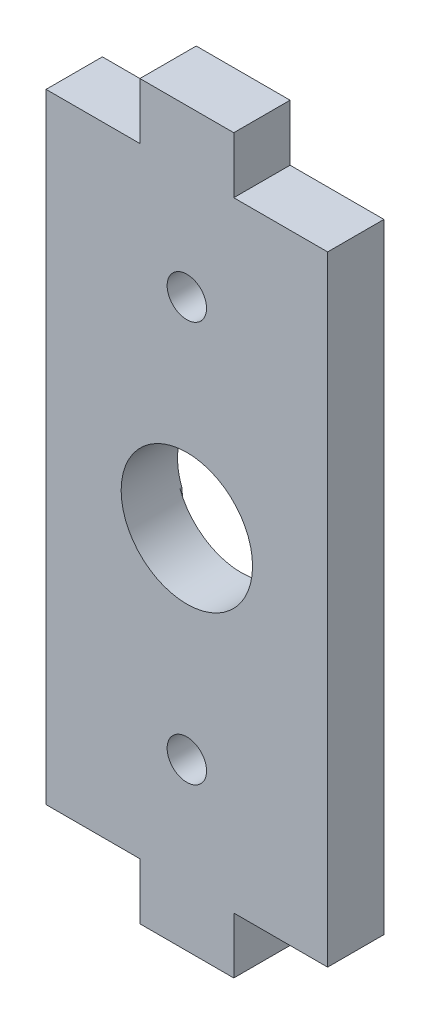
ISO-10303-21;
HEADER;
FILE_DESCRIPTION(('STEP AP214'),'2;1');
FILE_NAME('part.step','',(''),(''),'','','');
FILE_SCHEMA(('AUTOMOTIVE_DESIGN { 1 0 10303 214 1 1 1 1 }'));
ENDSEC;
DATA;
#1=APPLICATION_CONTEXT('core data for automotive mechanical design processes');
#2=APPLICATION_PROTOCOL_DEFINITION('international standard','automotive_design',2000,#1);
#3=PRODUCT_CONTEXT('',#1,'mechanical');
#4=PRODUCT('Part','Part','',(#3));
#5=PRODUCT_RELATED_PRODUCT_CATEGORY('part','',(#4));
#6=PRODUCT_DEFINITION_FORMATION('','',#4);
#7=PRODUCT_DEFINITION_CONTEXT('part definition',#1,'design');
#8=PRODUCT_DEFINITION('design','',#6,#7);
#9=PRODUCT_DEFINITION_SHAPE('','',#8);
#10=(LENGTH_UNIT() NAMED_UNIT(*) SI_UNIT(.MILLI.,.METRE.));
#11=(NAMED_UNIT(*) PLANE_ANGLE_UNIT() SI_UNIT($,.RADIAN.));
#12=(NAMED_UNIT(*) SI_UNIT($,.STERADIAN.) SOLID_ANGLE_UNIT());
#13=UNCERTAINTY_MEASURE_WITH_UNIT(LENGTH_MEASURE(1.E-05),#10,'distance_accuracy_value','');
#14=(GEOMETRIC_REPRESENTATION_CONTEXT(3) GLOBAL_UNCERTAINTY_ASSIGNED_CONTEXT((#13)) GLOBAL_UNIT_ASSIGNED_CONTEXT((#10,
#11,#12)) REPRESENTATION_CONTEXT('',''));
#15=CARTESIAN_POINT('',(0.,0.,0.));
#16=DIRECTION('',(0.,0.,1.));
#17=DIRECTION('',(1.,0.,0.));
#18=AXIS2_PLACEMENT_3D('',#15,#16,#17);
#19=CARTESIAN_POINT('',(0.,0.,0.));
#20=DIRECTION('',(0.,0.,-1.));
#21=DIRECTION('',(-1.,0.,0.));
#22=AXIS2_PLACEMENT_3D('',#19,#20,#21);
#23=PLANE('',#22);
#24=DIRECTION('',(0.,1.,0.));
#25=VECTOR('',#24,1.);
#26=CARTESIAN_POINT('',(28.7000000000005,-4.20000000000046,0.));
#27=LINE('',#26,#25);
#28=CARTESIAN_POINT('',(28.7000000000005,-4.20000000000046,0.));
#29=VERTEX_POINT('',#28);
#30=CARTESIAN_POINT('',(28.7000000000005,-1.20000000000046,0.));
#31=VERTEX_POINT('',#30);
#32=EDGE_CURVE('E247',#29,#31,#27,.T.);
#33=ORIENTED_EDGE('',*,*,#32,.F.);
#34=DIRECTION('',(1.,0.,0.));
#35=VECTOR('',#34,1.);
#36=CARTESIAN_POINT('',(28.7000000000005,-4.20000000000046,0.));
#37=LINE('',#36,#35);
#38=CARTESIAN_POINT('',(23.7000000000005,-4.20000000000046,0.));
#39=VERTEX_POINT('',#38);
#40=EDGE_CURVE('E252',#39,#29,#37,.T.);
#41=ORIENTED_EDGE('',*,*,#40,.F.);
#42=DIRECTION('',(0.,-1.,0.));
#43=VECTOR('',#42,1.);
#44=CARTESIAN_POINT('',(23.7000000000005,-1.20000000000046,0.));
#45=LINE('',#44,#43);
#46=CARTESIAN_POINT('',(23.7000000000005,-1.20000000000046,0.));
#47=VERTEX_POINT('',#46);
#48=EDGE_CURVE('E297',#47,#39,#45,.T.);
#49=ORIENTED_EDGE('',*,*,#48,.F.);
#50=DIRECTION('',(1.,0.,0.));
#51=VECTOR('',#50,1.);
#52=CARTESIAN_POINT('',(18.6999999999996,-1.20000000000046,0.));
#53=LINE('',#52,#51);
#54=CARTESIAN_POINT('',(18.6999999999996,-1.20000000000046,0.));
#55=VERTEX_POINT('',#54);
#56=EDGE_CURVE('E295',#55,#47,#53,.T.);
#57=ORIENTED_EDGE('',*,*,#56,.F.);
#58=DIRECTION('',(0.,-1.,0.));
#59=VECTOR('',#58,1.);
#60=CARTESIAN_POINT('',(18.6999999999996,9.79999999999946,0.));
#61=LINE('',#60,#59);
#62=CARTESIAN_POINT('',(18.6999999999996,31.8000000000005,0.));
#63=VERTEX_POINT('',#62);
#64=EDGE_CURVE('E293',#63,#55,#61,.T.);
#65=ORIENTED_EDGE('',*,*,#64,.F.);
#66=DIRECTION('',(-1.,0.,0.));
#67=VECTOR('',#66,1.);
#68=CARTESIAN_POINT('',(23.7000000000005,31.8000000000005,0.));
#69=LINE('',#68,#67);
#70=CARTESIAN_POINT('',(23.7000000000005,31.8000000000005,0.));
#71=VERTEX_POINT('',#70);
#72=EDGE_CURVE('E290',#71,#63,#69,.T.);
#73=ORIENTED_EDGE('',*,*,#72,.F.);
#74=DIRECTION('',(0.,-1.,0.));
#75=VECTOR('',#74,1.);
#76=CARTESIAN_POINT('',(23.7000000000005,34.8000000000005,0.));
#77=LINE('',#76,#75);
#78=CARTESIAN_POINT('',(23.7000000000005,34.8000000000005,0.));
#79=VERTEX_POINT('',#78);
#80=EDGE_CURVE('E288',#79,#71,#77,.T.);
#81=ORIENTED_EDGE('',*,*,#80,.F.);
#82=DIRECTION('',(-1.,0.,0.));
#83=VECTOR('',#82,1.);
#84=CARTESIAN_POINT('',(28.7000000000005,34.8000000000005,0.));
#85=LINE('',#84,#83);
#86=CARTESIAN_POINT('',(28.7000000000005,34.8000000000005,0.));
#87=VERTEX_POINT('',#86);
#88=EDGE_CURVE('E286',#87,#79,#85,.T.);
#89=ORIENTED_EDGE('',*,*,#88,.F.);
#90=DIRECTION('',(0.,1.,0.));
#91=VECTOR('',#90,1.);
#92=CARTESIAN_POINT('',(28.7000000000005,31.8000000000005,0.));
#93=LINE('',#92,#91);
#94=CARTESIAN_POINT('',(28.7000000000005,31.8000000000005,0.));
#95=VERTEX_POINT('',#94);
#96=EDGE_CURVE('E284',#95,#87,#93,.T.);
#97=ORIENTED_EDGE('',*,*,#96,.F.);
#98=DIRECTION('',(-1.,0.,0.));
#99=VECTOR('',#98,1.);
#100=CARTESIAN_POINT('',(33.7000000000005,31.8000000000005,0.));
#101=LINE('',#100,#99);
#102=CARTESIAN_POINT('',(33.7000000000005,31.8000000000005,0.));
#103=VERTEX_POINT('',#102);
#104=EDGE_CURVE('E282',#103,#95,#101,.T.);
#105=ORIENTED_EDGE('',*,*,#104,.F.);
#106=DIRECTION('',(0.,1.,0.));
#107=VECTOR('',#106,1.);
#108=CARTESIAN_POINT('',(33.7000000000005,15.8000000000001,0.));
#109=LINE('',#108,#107);
#110=CARTESIAN_POINT('',(33.7000000000005,-1.20000000000046,0.));
#111=VERTEX_POINT('',#110);
#112=EDGE_CURVE('E280',#111,#103,#109,.T.);
#113=ORIENTED_EDGE('',*,*,#112,.F.);
#114=DIRECTION('',(1.,0.,0.));
#115=VECTOR('',#114,1.);
#116=CARTESIAN_POINT('',(28.7000000000005,-1.20000000000046,0.));
#117=LINE('',#116,#115);
#118=EDGE_CURVE('E277',#31,#111,#117,.T.);
#119=ORIENTED_EDGE('',*,*,#118,.F.);
#120=EDGE_LOOP('',(#33,#41,#49,#57,#65,#73,#81,#89,#97,#105,#113,#119));
#121=FACE_BOUND('',#120,.T.);
#122=CARTESIAN_POINT('',(26.2000000000005,15.2999999999997,0.));
#123=DIRECTION('',(0.,0.,1.));
#124=DIRECTION('',(1.,0.,0.));
#125=AXIS2_PLACEMENT_3D('',#122,#123,#124);
#126=CIRCLE('',#125,3.5);
#127=CARTESIAN_POINT('',(22.9308257923256,16.5499999999897,0.));
#128=VERTEX_POINT('',#127);
#129=CARTESIAN_POINT('',(22.9308257922595,14.0500000001457,0.));
#130=VERTEX_POINT('',#129);
#131=EDGE_CURVE('E239',#128,#130,#126,.T.);
#132=ORIENTED_EDGE('',*,*,#131,.T.);
#133=DIRECTION('',(0.0967980247525778,-0.995304045206287,0.));
#134=VECTOR('',#133,1.);
#135=CARTESIAN_POINT('',(24.1999999999996,1.00000000000055,0.));
#136=LINE('',#135,#134);
#137=CARTESIAN_POINT('',(24.1999999999996,1.00000000000055,0.));
#138=VERTEX_POINT('',#137);
#139=EDGE_CURVE('E197',#130,#138,#136,.T.);
#140=ORIENTED_EDGE('',*,*,#139,.T.);
#141=CARTESIAN_POINT('',(26.2,1.00000000000055,0.));
#142=DIRECTION('',(0.,0.,1.));
#143=DIRECTION('',(1.,0.,0.));
#144=AXIS2_PLACEMENT_3D('',#141,#142,#143);
#145=CIRCLE('',#144,2.00000000000045);
#146=CARTESIAN_POINT('',(28.2000000000005,1.00000000000055,0.));
#147=VERTEX_POINT('',#146);
#148=EDGE_CURVE('E185',#138,#147,#145,.T.);
#149=ORIENTED_EDGE('',*,*,#148,.T.);
#150=DIRECTION('',(0.0967980247485113,0.995304045206683,0.));
#151=VECTOR('',#150,1.);
#152=CARTESIAN_POINT('',(29.4691742076735,14.0500000000095,0.));
#153=LINE('',#152,#151);
#154=CARTESIAN_POINT('',(29.4691742076735,14.0500000000095,0.));
#155=VERTEX_POINT('',#154);
#156=EDGE_CURVE('E200',#147,#155,#153,.T.);
#157=ORIENTED_EDGE('',*,*,#156,.T.);
#158=CARTESIAN_POINT('',(29.4691742077414,16.5499999998535,0.));
#159=VERTEX_POINT('',#158);
#160=EDGE_CURVE('E234',#155,#159,#126,.T.);
#161=ORIENTED_EDGE('',*,*,#160,.T.);
#162=DIRECTION('',(-0.0983012262714601,0.995156705706959,0.));
#163=VECTOR('',#162,1.);
#164=CARTESIAN_POINT('',(28.1903134114006,29.4966024525005,0.));
#165=LINE('',#164,#163);
#166=CARTESIAN_POINT('',(28.1903134114006,29.4966024525005,0.));
#167=VERTEX_POINT('',#166);
#168=EDGE_CURVE('E217',#159,#167,#165,.T.);
#169=ORIENTED_EDGE('',*,*,#168,.T.);
#170=CARTESIAN_POINT('',(26.1999999999917,29.2999999999868,0.));
#171=DIRECTION('',(0.,0.,1.));
#172=DIRECTION('',(1.,0.,0.));
#173=AXIS2_PLACEMENT_3D('',#170,#171,#172);
#174=CIRCLE('',#173,1.99999999999215);
#175=CARTESIAN_POINT('',(24.1999999999996,29.2999999999868,0.));
#176=VERTEX_POINT('',#175);
#177=EDGE_CURVE('E220',#167,#176,#174,.T.);
#178=ORIENTED_EDGE('',*,*,#177,.T.);
#179=DIRECTION('',(-0.0990535328176179,-0.995082105977366,0.));
#180=VECTOR('',#179,1.);
#181=CARTESIAN_POINT('',(22.9308257923256,16.5499999999897,0.));
#182=LINE('',#181,#180);
#183=EDGE_CURVE('E210',#176,#128,#182,.T.);
#184=ORIENTED_EDGE('',*,*,#183,.T.);
#185=EDGE_LOOP('',(#132,#140,#149,#157,#161,#169,#178,#184));
#186=FACE_BOUND('',#185,.T.);
#187=ADVANCED_FACE('F33',(#121,#186),#23,.T.);
#188=CARTESIAN_POINT('',(26.2000000000005,15.2999999999997,3.));
#189=DIRECTION('',(0.,0.,-1.));
#190=DIRECTION('',(-1.,0.,0.));
#191=AXIS2_PLACEMENT_3D('',#188,#189,#190);
#192=CYLINDRICAL_SURFACE('',#191,3.5);
#193=CARTESIAN_POINT('',(26.2000000000005,15.2999999999997,3.));
#194=DIRECTION('',(0.,0.,1.));
#195=DIRECTION('',(1.,0.,0.));
#196=AXIS2_PLACEMENT_3D('',#193,#194,#195);
#197=CIRCLE('',#196,3.5);
#198=CARTESIAN_POINT('',(29.7000000000005,15.2999999999997,3.));
#199=VERTEX_POINT('',#198);
#200=EDGE_CURVE('E235',#199,#199,#197,.T.);
#201=ORIENTED_EDGE('',*,*,#200,.T.);
#202=EDGE_LOOP('',(#201));
#203=FACE_BOUND('',#202,.T.);
#204=CARTESIAN_POINT('',(26.2000000000075,15.3000000000575,0.1));
#205=DIRECTION('',(0.,0.,-1.));
#206=DIRECTION('',(1.,0.,0.));
#207=AXIS2_PLACEMENT_3D('',#204,#205,#206);
#208=CIRCLE('',#207,3.50000000004092);
#209=CARTESIAN_POINT('',(29.4691742076735,14.0500000000095,0.1));
#210=VERTEX_POINT('',#209);
#211=CARTESIAN_POINT('',(22.9308257922853,14.0500000001555,0.0999999999999998));
#212=VERTEX_POINT('',#211);
#213=EDGE_CURVE('E179',#210,#212,#208,.T.);
#214=ORIENTED_EDGE('',*,*,#213,.T.);
#215=DIRECTION('',(0.,0.,-1.));
#216=VECTOR('',#215,1.);
#217=CARTESIAN_POINT('',(22.9308257922595,14.0500000001457,0.1));
#218=LINE('',#217,#216);
#219=EDGE_CURVE('E49',#212,#130,#218,.T.);
#220=ORIENTED_EDGE('',*,*,#219,.T.);
#221=ORIENTED_EDGE('',*,*,#131,.F.);
#222=DIRECTION('',(0.,0.,-1.));
#223=VECTOR('',#222,1.);
#224=CARTESIAN_POINT('',(22.9308257923256,16.5499999999897,0.1));
#225=LINE('',#224,#223);
#226=CARTESIAN_POINT('',(22.9308257923256,16.5499999999897,0.1));
#227=VERTEX_POINT('',#226);
#228=EDGE_CURVE('E216',#227,#128,#225,.T.);
#229=ORIENTED_EDGE('',*,*,#228,.F.);
#230=CARTESIAN_POINT('',(26.2000000000075,15.3000000000575,0.1));
#231=DIRECTION('',(0.,0.,-1.));
#232=DIRECTION('',(1.,0.,0.));
#233=AXIS2_PLACEMENT_3D('',#230,#231,#232);
#234=CIRCLE('',#233,3.5000000000004);
#235=CARTESIAN_POINT('',(29.4691742077156,16.5499999998437,0.0999999999999998));
#236=VERTEX_POINT('',#235);
#237=EDGE_CURVE('E206',#227,#236,#234,.T.);
#238=ORIENTED_EDGE('',*,*,#237,.T.);
#239=DIRECTION('',(0.,0.,-1.));
#240=VECTOR('',#239,1.);
#241=CARTESIAN_POINT('',(29.4691742077414,16.5499999998535,0.1));
#242=LINE('',#241,#240);
#243=EDGE_CURVE('E57',#236,#159,#242,.T.);
#244=ORIENTED_EDGE('',*,*,#243,.T.);
#245=ORIENTED_EDGE('',*,*,#160,.F.);
#246=DIRECTION('',(0.,0.,-1.));
#247=VECTOR('',#246,1.);
#248=CARTESIAN_POINT('',(29.4691742076735,14.0500000000095,0.1));
#249=LINE('',#248,#247);
#250=EDGE_CURVE('E193',#210,#155,#249,.T.);
#251=ORIENTED_EDGE('',*,*,#250,.F.);
#252=EDGE_LOOP('',(#214,#220,#221,#229,#238,#244,#245,#251));
#253=FACE_BOUND('',#252,.T.);
#254=ADVANCED_FACE('F399',(#203,#253),#192,.F.);
#255=CARTESIAN_POINT('',(0.,0.,3.));
#256=DIRECTION('',(0.,0.,-1.));
#257=DIRECTION('',(-1.,0.,0.));
#258=AXIS2_PLACEMENT_3D('',#255,#256,#257);
#259=PLANE('',#258);
#260=DIRECTION('',(0.,1.,0.));
#261=VECTOR('',#260,1.);
#262=CARTESIAN_POINT('',(28.7000000000005,-4.20000000000046,3.));
#263=LINE('',#262,#261);
#264=CARTESIAN_POINT('',(28.7000000000005,-4.20000000000046,3.));
#265=VERTEX_POINT('',#264);
#266=CARTESIAN_POINT('',(28.7000000000005,-1.20000000000046,3.));
#267=VERTEX_POINT('',#266);
#268=EDGE_CURVE('E248',#265,#267,#263,.T.);
#269=ORIENTED_EDGE('',*,*,#268,.T.);
#270=DIRECTION('',(1.,0.,0.));
#271=VECTOR('',#270,1.);
#272=CARTESIAN_POINT('',(28.7000000000005,-1.20000000000046,3.));
#273=LINE('',#272,#271);
#274=CARTESIAN_POINT('',(33.7000000000005,-1.20000000000046,3.));
#275=VERTEX_POINT('',#274);
#276=EDGE_CURVE('E251',#267,#275,#273,.T.);
#277=ORIENTED_EDGE('',*,*,#276,.T.);
#278=DIRECTION('',(0.,1.,0.));
#279=VECTOR('',#278,1.);
#280=CARTESIAN_POINT('',(33.7000000000005,-1.20000000000046,3.));
#281=LINE('',#280,#279);
#282=CARTESIAN_POINT('',(33.7000000000005,31.8000000000005,3.));
#283=VERTEX_POINT('',#282);
#284=EDGE_CURVE('E254',#275,#283,#281,.T.);
#285=ORIENTED_EDGE('',*,*,#284,.T.);
#286=DIRECTION('',(-1.,0.,0.));
#287=VECTOR('',#286,1.);
#288=CARTESIAN_POINT('',(33.7000000000005,31.8000000000005,3.));
#289=LINE('',#288,#287);
#290=CARTESIAN_POINT('',(28.7000000000005,31.8000000000005,3.));
#291=VERTEX_POINT('',#290);
#292=EDGE_CURVE('E256',#283,#291,#289,.T.);
#293=ORIENTED_EDGE('',*,*,#292,.T.);
#294=DIRECTION('',(0.,1.,0.));
#295=VECTOR('',#294,1.);
#296=CARTESIAN_POINT('',(28.7000000000005,31.8000000000005,3.));
#297=LINE('',#296,#295);
#298=CARTESIAN_POINT('',(28.7000000000005,34.8000000000005,3.));
#299=VERTEX_POINT('',#298);
#300=EDGE_CURVE('E258',#291,#299,#297,.T.);
#301=ORIENTED_EDGE('',*,*,#300,.T.);
#302=DIRECTION('',(-1.,0.,0.));
#303=VECTOR('',#302,1.);
#304=CARTESIAN_POINT('',(28.7000000000005,34.8000000000005,3.));
#305=LINE('',#304,#303);
#306=CARTESIAN_POINT('',(23.7000000000005,34.8000000000005,3.));
#307=VERTEX_POINT('',#306);
#308=EDGE_CURVE('E260',#299,#307,#305,.T.);
#309=ORIENTED_EDGE('',*,*,#308,.T.);
#310=DIRECTION('',(0.,-1.,0.));
#311=VECTOR('',#310,1.);
#312=CARTESIAN_POINT('',(23.7000000000005,34.8000000000005,3.));
#313=LINE('',#312,#311);
#314=CARTESIAN_POINT('',(23.7000000000005,31.8000000000005,3.));
#315=VERTEX_POINT('',#314);
#316=EDGE_CURVE('E262',#307,#315,#313,.T.);
#317=ORIENTED_EDGE('',*,*,#316,.T.);
#318=DIRECTION('',(-1.,0.,0.));
#319=VECTOR('',#318,1.);
#320=CARTESIAN_POINT('',(23.7000000000005,31.8000000000005,3.));
#321=LINE('',#320,#319);
#322=CARTESIAN_POINT('',(18.6999999999996,31.8000000000005,3.));
#323=VERTEX_POINT('',#322);
#324=EDGE_CURVE('E264',#315,#323,#321,.T.);
#325=ORIENTED_EDGE('',*,*,#324,.T.);
#326=DIRECTION('',(0.,-1.,0.));
#327=VECTOR('',#326,1.);
#328=CARTESIAN_POINT('',(18.6999999999996,31.8000000000005,3.));
#329=LINE('',#328,#327);
#330=CARTESIAN_POINT('',(18.6999999999996,-1.20000000000046,3.));
#331=VERTEX_POINT('',#330);
#332=EDGE_CURVE('E266',#323,#331,#329,.T.);
#333=ORIENTED_EDGE('',*,*,#332,.T.);
#334=DIRECTION('',(1.,0.,0.));
#335=VECTOR('',#334,1.);
#336=CARTESIAN_POINT('',(18.6999999999996,-1.20000000000046,3.));
#337=LINE('',#336,#335);
#338=CARTESIAN_POINT('',(23.7000000000005,-1.20000000000046,3.));
#339=VERTEX_POINT('',#338);
#340=EDGE_CURVE('E268',#331,#339,#337,.T.);
#341=ORIENTED_EDGE('',*,*,#340,.T.);
#342=DIRECTION('',(0.,-1.,0.));
#343=VECTOR('',#342,1.);
#344=CARTESIAN_POINT('',(23.7000000000005,-1.20000000000046,3.));
#345=LINE('',#344,#343);
#346=CARTESIAN_POINT('',(23.7000000000005,-4.20000000000046,3.));
#347=VERTEX_POINT('',#346);
#348=EDGE_CURVE('E270',#339,#347,#345,.T.);
#349=ORIENTED_EDGE('',*,*,#348,.T.);
#350=DIRECTION('',(1.,0.,0.));
#351=VECTOR('',#350,1.);
#352=CARTESIAN_POINT('',(28.7000000000005,-4.20000000000046,3.));
#353=LINE('',#352,#351);
#354=EDGE_CURVE('E272',#347,#265,#353,.T.);
#355=ORIENTED_EDGE('',*,*,#354,.T.);
#356=EDGE_LOOP('',(#269,#277,#285,#293,#301,#309,#317,#325,#333,#341,#349,#355));
#357=FACE_BOUND('',#356,.T.);
#358=CARTESIAN_POINT('',(26.2000000000005,25.9722294535005,3.));
#359=DIRECTION('',(0.,0.,1.));
#360=DIRECTION('',(1.,0.,0.));
#361=AXIS2_PLACEMENT_3D('',#358,#359,#360);
#362=CIRCLE('',#361,1.05);
#363=CARTESIAN_POINT('',(27.2500000000005,25.9722294535005,3.));
#364=VERTEX_POINT('',#363);
#365=EDGE_CURVE('E244',#364,#364,#362,.T.);
#366=ORIENTED_EDGE('',*,*,#365,.F.);
#367=EDGE_LOOP('',(#366));
#368=FACE_BOUND('',#367,.T.);
#369=CARTESIAN_POINT('',(26.2000000000005,4.62777054650046,3.));
#370=DIRECTION('',(0.,0.,1.));
#371=DIRECTION('',(1.,0.,0.));
#372=AXIS2_PLACEMENT_3D('',#369,#370,#371);
#373=CIRCLE('',#372,1.05);
#374=CARTESIAN_POINT('',(27.2500000000005,4.62777054650046,3.));
#375=VERTEX_POINT('',#374);
#376=EDGE_CURVE('E238',#375,#375,#373,.T.);
#377=ORIENTED_EDGE('',*,*,#376,.F.);
#378=EDGE_LOOP('',(#377));
#379=FACE_BOUND('',#378,.T.);
#380=ORIENTED_EDGE('',*,*,#200,.F.);
#381=EDGE_LOOP('',(#380));
#382=FACE_BOUND('',#381,.T.);
#383=ADVANCED_FACE('F355',(#357,#368,#379,#382),#259,.F.);
#384=CARTESIAN_POINT('',(28.7000000000005,-4.20000000000046,3.));
#385=DIRECTION('',(-1.,0.,0.));
#386=DIRECTION('',(0.,0.,1.));
#387=AXIS2_PLACEMENT_3D('',#384,#385,#386);
#388=PLANE('',#387);
#389=ORIENTED_EDGE('',*,*,#32,.T.);
#390=DIRECTION('',(0.,0.,-1.));
#391=VECTOR('',#390,1.);
#392=CARTESIAN_POINT('',(28.7000000000005,-1.20000000000046,3.));
#393=LINE('',#392,#391);
#394=EDGE_CURVE('E11',#267,#31,#393,.T.);
#395=ORIENTED_EDGE('',*,*,#394,.F.);
#396=ORIENTED_EDGE('',*,*,#268,.F.);
#397=DIRECTION('',(0.,0.,-1.));
#398=VECTOR('',#397,1.);
#399=CARTESIAN_POINT('',(28.7000000000005,-4.20000000000046,3.));
#400=LINE('',#399,#398);
#401=EDGE_CURVE('E274',#265,#29,#400,.T.);
#402=ORIENTED_EDGE('',*,*,#401,.T.);
#403=EDGE_LOOP('',(#389,#395,#396,#402));
#404=FACE_BOUND('',#403,.T.);
#405=ADVANCED_FACE('F35',(#404),#388,.F.);
#406=CARTESIAN_POINT('',(28.7000000000005,-1.20000000000046,3.));
#407=DIRECTION('',(0.,1.,0.));
#408=DIRECTION('',(0.,0.,1.));
#409=AXIS2_PLACEMENT_3D('',#406,#407,#408);
#410=PLANE('',#409);
#411=ORIENTED_EDGE('',*,*,#118,.T.);
#412=DIRECTION('',(0.,0.,-1.));
#413=VECTOR('',#412,1.);
#414=CARTESIAN_POINT('',(33.7000000000005,-1.20000000000046,3.));
#415=LINE('',#414,#413);
#416=EDGE_CURVE('E42',#275,#111,#415,.T.);
#417=ORIENTED_EDGE('',*,*,#416,.F.);
#418=ORIENTED_EDGE('',*,*,#276,.F.);
#419=ORIENTED_EDGE('',*,*,#394,.T.);
#420=EDGE_LOOP('',(#411,#417,#418,#419));
#421=FACE_BOUND('',#420,.T.);
#422=ADVANCED_FACE('F336',(#421),#410,.F.);
#423=CARTESIAN_POINT('',(33.7000000000005,15.8000000000001,3.));
#424=DIRECTION('',(-1.,0.,0.));
#425=DIRECTION('',(0.,0.,1.));
#426=AXIS2_PLACEMENT_3D('',#423,#424,#425);
#427=PLANE('',#426);
#428=ORIENTED_EDGE('',*,*,#112,.T.);
#429=DIRECTION('',(0.,0.,-1.));
#430=VECTOR('',#429,1.);
#431=CARTESIAN_POINT('',(33.7000000000005,31.8000000000005,3.));
#432=LINE('',#431,#430);
#433=EDGE_CURVE('E326',#283,#103,#432,.T.);
#434=ORIENTED_EDGE('',*,*,#433,.F.);
#435=ORIENTED_EDGE('',*,*,#284,.F.);
#436=ORIENTED_EDGE('',*,*,#416,.T.);
#437=EDGE_LOOP('',(#428,#434,#435,#436));
#438=FACE_BOUND('',#437,.T.);
#439=ADVANCED_FACE('F333',(#438),#427,.F.);
#440=CARTESIAN_POINT('',(33.7000000000005,31.8000000000005,3.));
#441=DIRECTION('',(0.,-1.,0.));
#442=DIRECTION('',(0.,0.,-1.));
#443=AXIS2_PLACEMENT_3D('',#440,#441,#442);
#444=PLANE('',#443);
#445=ORIENTED_EDGE('',*,*,#104,.T.);
#446=DIRECTION('',(0.,0.,-1.));
#447=VECTOR('',#446,1.);
#448=CARTESIAN_POINT('',(28.7000000000005,31.8000000000005,3.));
#449=LINE('',#448,#447);
#450=EDGE_CURVE('E323',#291,#95,#449,.T.);
#451=ORIENTED_EDGE('',*,*,#450,.F.);
#452=ORIENTED_EDGE('',*,*,#292,.F.);
#453=ORIENTED_EDGE('',*,*,#433,.T.);
#454=EDGE_LOOP('',(#445,#451,#452,#453));
#455=FACE_BOUND('',#454,.T.);
#456=ADVANCED_FACE('F347',(#455),#444,.F.);
#457=CARTESIAN_POINT('',(28.7000000000005,31.8000000000005,3.));
#458=DIRECTION('',(-1.,0.,0.));
#459=DIRECTION('',(0.,0.,1.));
#460=AXIS2_PLACEMENT_3D('',#457,#458,#459);
#461=PLANE('',#460);
#462=ORIENTED_EDGE('',*,*,#96,.T.);
#463=DIRECTION('',(0.,0.,-1.));
#464=VECTOR('',#463,1.);
#465=CARTESIAN_POINT('',(28.7000000000005,34.8000000000005,3.));
#466=LINE('',#465,#464);
#467=EDGE_CURVE('E320',#299,#87,#466,.T.);
#468=ORIENTED_EDGE('',*,*,#467,.F.);
#469=ORIENTED_EDGE('',*,*,#300,.F.);
#470=ORIENTED_EDGE('',*,*,#450,.T.);
#471=EDGE_LOOP('',(#462,#468,#469,#470));
#472=FACE_BOUND('',#471,.T.);
#473=ADVANCED_FACE('F351',(#472),#461,.F.);
#474=CARTESIAN_POINT('',(28.7000000000005,34.8000000000005,3.));
#475=DIRECTION('',(0.,-1.,0.));
#476=DIRECTION('',(0.,0.,-1.));
#477=AXIS2_PLACEMENT_3D('',#474,#475,#476);
#478=PLANE('',#477);
#479=ORIENTED_EDGE('',*,*,#88,.T.);
#480=DIRECTION('',(0.,0.,-1.));
#481=VECTOR('',#480,1.);
#482=CARTESIAN_POINT('',(23.7000000000005,34.8000000000005,3.));
#483=LINE('',#482,#481);
#484=EDGE_CURVE('E317',#307,#79,#483,.T.);
#485=ORIENTED_EDGE('',*,*,#484,.F.);
#486=ORIENTED_EDGE('',*,*,#308,.F.);
#487=ORIENTED_EDGE('',*,*,#467,.T.);
#488=EDGE_LOOP('',(#479,#485,#486,#487));
#489=FACE_BOUND('',#488,.T.);
#490=ADVANCED_FACE('F389',(#489),#478,.F.);
#491=CARTESIAN_POINT('',(23.7000000000005,34.8000000000005,3.));
#492=DIRECTION('',(1.,0.,0.));
#493=DIRECTION('',(0.,0.,-1.));
#494=AXIS2_PLACEMENT_3D('',#491,#492,#493);
#495=PLANE('',#494);
#496=ORIENTED_EDGE('',*,*,#80,.T.);
#497=DIRECTION('',(0.,0.,-1.));
#498=VECTOR('',#497,1.);
#499=CARTESIAN_POINT('',(23.7000000000005,31.8000000000005,3.));
#500=LINE('',#499,#498);
#501=EDGE_CURVE('E314',#315,#71,#500,.T.);
#502=ORIENTED_EDGE('',*,*,#501,.F.);
#503=ORIENTED_EDGE('',*,*,#316,.F.);
#504=ORIENTED_EDGE('',*,*,#484,.T.);
#505=EDGE_LOOP('',(#496,#502,#503,#504));
#506=FACE_BOUND('',#505,.T.);
#507=ADVANCED_FACE('F387',(#506),#495,.F.);
#508=CARTESIAN_POINT('',(23.7000000000005,31.8000000000005,3.));
#509=DIRECTION('',(0.,-1.,0.));
#510=DIRECTION('',(0.,0.,-1.));
#511=AXIS2_PLACEMENT_3D('',#508,#509,#510);
#512=PLANE('',#511);
#513=ORIENTED_EDGE('',*,*,#72,.T.);
#514=DIRECTION('',(0.,0.,-1.));
#515=VECTOR('',#514,1.);
#516=CARTESIAN_POINT('',(18.6999999999996,31.8000000000005,3.));
#517=LINE('',#516,#515);
#518=EDGE_CURVE('E311',#323,#63,#517,.T.);
#519=ORIENTED_EDGE('',*,*,#518,.F.);
#520=ORIENTED_EDGE('',*,*,#324,.F.);
#521=ORIENTED_EDGE('',*,*,#501,.T.);
#522=EDGE_LOOP('',(#513,#519,#520,#521));
#523=FACE_BOUND('',#522,.T.);
#524=ADVANCED_FACE('F382',(#523),#512,.F.);
#525=CARTESIAN_POINT('',(18.6999999999996,9.79999999999946,3.));
#526=DIRECTION('',(1.,0.,0.));
#527=DIRECTION('',(0.,0.,-1.));
#528=AXIS2_PLACEMENT_3D('',#525,#526,#527);
#529=PLANE('',#528);
#530=ORIENTED_EDGE('',*,*,#64,.T.);
#531=DIRECTION('',(0.,0.,-1.));
#532=VECTOR('',#531,1.);
#533=CARTESIAN_POINT('',(18.6999999999996,-1.20000000000046,3.));
#534=LINE('',#533,#532);
#535=EDGE_CURVE('E308',#331,#55,#534,.T.);
#536=ORIENTED_EDGE('',*,*,#535,.F.);
#537=ORIENTED_EDGE('',*,*,#332,.F.);
#538=ORIENTED_EDGE('',*,*,#518,.T.);
#539=EDGE_LOOP('',(#530,#536,#537,#538));
#540=FACE_BOUND('',#539,.T.);
#541=ADVANCED_FACE('F377',(#540),#529,.F.);
#542=CARTESIAN_POINT('',(18.6999999999996,-1.20000000000046,3.));
#543=DIRECTION('',(0.,1.,0.));
#544=DIRECTION('',(0.,0.,1.));
#545=AXIS2_PLACEMENT_3D('',#542,#543,#544);
#546=PLANE('',#545);
#547=ORIENTED_EDGE('',*,*,#56,.T.);
#548=DIRECTION('',(0.,0.,-1.));
#549=VECTOR('',#548,1.);
#550=CARTESIAN_POINT('',(23.7000000000005,-1.20000000000046,3.));
#551=LINE('',#550,#549);
#552=EDGE_CURVE('E305',#339,#47,#551,.T.);
#553=ORIENTED_EDGE('',*,*,#552,.F.);
#554=ORIENTED_EDGE('',*,*,#340,.F.);
#555=ORIENTED_EDGE('',*,*,#535,.T.);
#556=EDGE_LOOP('',(#547,#553,#554,#555));
#557=FACE_BOUND('',#556,.T.);
#558=ADVANCED_FACE('F373',(#557),#546,.F.);
#559=CARTESIAN_POINT('',(23.7000000000005,-1.20000000000046,3.));
#560=DIRECTION('',(1.,0.,0.));
#561=DIRECTION('',(0.,0.,-1.));
#562=AXIS2_PLACEMENT_3D('',#559,#560,#561);
#563=PLANE('',#562);
#564=ORIENTED_EDGE('',*,*,#48,.T.);
#565=DIRECTION('',(0.,0.,-1.));
#566=VECTOR('',#565,1.);
#567=CARTESIAN_POINT('',(23.7000000000005,-4.20000000000046,3.));
#568=LINE('',#567,#566);
#569=EDGE_CURVE('E302',#347,#39,#568,.T.);
#570=ORIENTED_EDGE('',*,*,#569,.F.);
#571=ORIENTED_EDGE('',*,*,#348,.F.);
#572=ORIENTED_EDGE('',*,*,#552,.T.);
#573=EDGE_LOOP('',(#564,#570,#571,#572));
#574=FACE_BOUND('',#573,.T.);
#575=ADVANCED_FACE('F368',(#574),#563,.F.);
#576=CARTESIAN_POINT('',(28.7000000000005,-4.20000000000046,3.));
#577=DIRECTION('',(0.,1.,0.));
#578=DIRECTION('',(0.,0.,1.));
#579=AXIS2_PLACEMENT_3D('',#576,#577,#578);
#580=PLANE('',#579);
#581=ORIENTED_EDGE('',*,*,#40,.T.);
#582=ORIENTED_EDGE('',*,*,#401,.F.);
#583=ORIENTED_EDGE('',*,*,#354,.F.);
#584=ORIENTED_EDGE('',*,*,#569,.T.);
#585=EDGE_LOOP('',(#581,#582,#583,#584));
#586=FACE_BOUND('',#585,.T.);
#587=ADVANCED_FACE('F363',(#586),#580,.F.);
#588=CARTESIAN_POINT('',(26.2000000000005,25.9722294535005,3.));
#589=DIRECTION('',(0.,0.,-1.));
#590=DIRECTION('',(-1.,0.,0.));
#591=AXIS2_PLACEMENT_3D('',#588,#589,#590);
#592=CYLINDRICAL_SURFACE('',#591,1.05);
#593=CARTESIAN_POINT('',(26.2000000000005,25.9722294535005,0.0999999999999998));
#594=DIRECTION('',(0.,0.,1.));
#595=DIRECTION('',(1.,0.,0.));
#596=AXIS2_PLACEMENT_3D('',#593,#594,#595);
#597=CIRCLE('',#596,1.05);
#598=CARTESIAN_POINT('',(27.2500000000005,25.9722294535005,0.0999999999999998));
#599=VERTEX_POINT('',#598);
#600=EDGE_CURVE('E231',#599,#599,#597,.T.);
#601=ORIENTED_EDGE('',*,*,#600,.F.);
#602=EDGE_LOOP('',(#601));
#603=FACE_BOUND('',#602,.T.);
#604=ORIENTED_EDGE('',*,*,#365,.T.);
#605=EDGE_LOOP('',(#604));
#606=FACE_BOUND('',#605,.T.);
#607=ADVANCED_FACE('F411',(#603,#606),#592,.F.);
#608=CARTESIAN_POINT('',(26.2000000000005,4.62777054650046,3.));
#609=DIRECTION('',(0.,0.,-1.));
#610=DIRECTION('',(-1.,0.,0.));
#611=AXIS2_PLACEMENT_3D('',#608,#609,#610);
#612=CYLINDRICAL_SURFACE('',#611,1.05);
#613=CARTESIAN_POINT('',(26.2000000000005,4.62777054650046,0.0999999999999998));
#614=DIRECTION('',(0.,0.,1.));
#615=DIRECTION('',(1.,0.,0.));
#616=AXIS2_PLACEMENT_3D('',#613,#614,#615);
#617=CIRCLE('',#616,1.05);
#618=CARTESIAN_POINT('',(27.2500000000005,4.62777054650046,0.0999999999999998));
#619=VERTEX_POINT('',#618);
#620=EDGE_CURVE('E37',#619,#619,#617,.T.);
#621=ORIENTED_EDGE('',*,*,#620,.F.);
#622=EDGE_LOOP('',(#621));
#623=FACE_BOUND('',#622,.T.);
#624=ORIENTED_EDGE('',*,*,#376,.T.);
#625=EDGE_LOOP('',(#624));
#626=FACE_BOUND('',#625,.T.);
#627=ADVANCED_FACE('F445',(#623,#626),#612,.F.);
#628=CARTESIAN_POINT('',(28.1903134114006,29.4966024525005,0.1));
#629=DIRECTION('',(-0.995156705706959,-0.09830122627146,0.));
#630=DIRECTION('',(0.0983012262714601,-0.995156705706959,0.));
#631=AXIS2_PLACEMENT_3D('',#628,#629,#630);
#632=PLANE('',#631);
#633=ORIENTED_EDGE('',*,*,#168,.F.);
#634=ORIENTED_EDGE('',*,*,#243,.F.);
#635=DIRECTION('',(-0.0983012262714601,0.995156705706959,0.));
#636=VECTOR('',#635,1.);
#637=CARTESIAN_POINT('',(28.1903134114006,29.4966024525005,0.1));
#638=LINE('',#637,#636);
#639=CARTESIAN_POINT('',(28.1903134114006,29.4966024525005,0.1));
#640=VERTEX_POINT('',#639);
#641=EDGE_CURVE('E209',#236,#640,#638,.T.);
#642=ORIENTED_EDGE('',*,*,#641,.T.);
#643=DIRECTION('',(0.,0.,-1.));
#644=VECTOR('',#643,1.);
#645=CARTESIAN_POINT('',(28.1903134114006,29.4966024525005,0.1));
#646=LINE('',#645,#644);
#647=EDGE_CURVE('E228',#640,#167,#646,.T.);
#648=ORIENTED_EDGE('',*,*,#647,.T.);
#649=EDGE_LOOP('',(#633,#634,#642,#648));
#650=FACE_BOUND('',#649,.T.);
#651=ADVANCED_FACE('F453',(#650),#632,.T.);
#652=CARTESIAN_POINT('',(26.1999999999917,29.2999999999868,0.1));
#653=DIRECTION('',(0.,0.,-1.));
#654=DIRECTION('',(-1.,0.,0.));
#655=AXIS2_PLACEMENT_3D('',#652,#653,#654);
#656=CYLINDRICAL_SURFACE('',#655,1.99999999999215);
#657=ORIENTED_EDGE('',*,*,#177,.F.);
#658=ORIENTED_EDGE('',*,*,#647,.F.);
#659=CARTESIAN_POINT('',(26.1999999999917,29.2999999999868,0.1));
#660=DIRECTION('',(0.,0.,1.));
#661=DIRECTION('',(1.,0.,0.));
#662=AXIS2_PLACEMENT_3D('',#659,#660,#661);
#663=CIRCLE('',#662,1.99999999999215);
#664=CARTESIAN_POINT('',(24.1999999999996,29.2999999999868,0.1));
#665=VERTEX_POINT('',#664);
#666=EDGE_CURVE('E212',#640,#665,#663,.T.);
#667=ORIENTED_EDGE('',*,*,#666,.T.);
#668=DIRECTION('',(0.,0.,-1.));
#669=VECTOR('',#668,1.);
#670=CARTESIAN_POINT('',(24.1999999999996,29.2999999999868,0.1));
#671=LINE('',#670,#669);
#672=EDGE_CURVE('E226',#665,#176,#671,.T.);
#673=ORIENTED_EDGE('',*,*,#672,.T.);
#674=EDGE_LOOP('',(#657,#658,#667,#673));
#675=FACE_BOUND('',#674,.T.);
#676=ADVANCED_FACE('F461',(#675),#656,.F.);
#677=CARTESIAN_POINT('',(22.9308257923256,16.5499999999897,0.1));
#678=DIRECTION('',(0.995082105977366,-0.0990535328176179,0.));
#679=DIRECTION('',(0.0990535328176179,0.995082105977366,0.));
#680=AXIS2_PLACEMENT_3D('',#677,#678,#679);
#681=PLANE('',#680);
#682=ORIENTED_EDGE('',*,*,#183,.F.);
#683=ORIENTED_EDGE('',*,*,#672,.F.);
#684=DIRECTION('',(-0.0990535328176179,-0.995082105977366,0.));
#685=VECTOR('',#684,1.);
#686=CARTESIAN_POINT('',(22.9308257923256,16.5499999999897,0.1));
#687=LINE('',#686,#685);
#688=EDGE_CURVE('E214',#665,#227,#687,.T.);
#689=ORIENTED_EDGE('',*,*,#688,.T.);
#690=ORIENTED_EDGE('',*,*,#228,.T.);
#691=EDGE_LOOP('',(#682,#683,#689,#690));
#692=FACE_BOUND('',#691,.T.);
#693=ADVANCED_FACE('F468',(#692),#681,.T.);
#694=CARTESIAN_POINT('',(26.2000000000075,15.3000000000575,0.1));
#695=DIRECTION('',(0.,0.,1.));
#696=DIRECTION('',(1.,0.,0.));
#697=AXIS2_PLACEMENT_3D('',#694,#695,#696);
#698=PLANE('',#697);
#699=ORIENTED_EDGE('',*,*,#600,.T.);
#700=EDGE_LOOP('',(#699));
#701=FACE_BOUND('',#700,.T.);
#702=ORIENTED_EDGE('',*,*,#237,.F.);
#703=ORIENTED_EDGE('',*,*,#688,.F.);
#704=ORIENTED_EDGE('',*,*,#666,.F.);
#705=ORIENTED_EDGE('',*,*,#641,.F.);
#706=EDGE_LOOP('',(#702,#703,#704,#705));
#707=FACE_BOUND('',#706,.T.);
#708=ADVANCED_FACE('F476',(#701,#707),#698,.F.);
#709=CARTESIAN_POINT('',(24.1999999999996,1.00000000000055,0.1));
#710=DIRECTION('',(0.995304045206287,0.0967980247525778,0.));
#711=DIRECTION('',(-0.0967980247525778,0.995304045206288,0.));
#712=AXIS2_PLACEMENT_3D('',#709,#710,#711);
#713=PLANE('',#712);
#714=ORIENTED_EDGE('',*,*,#139,.F.);
#715=ORIENTED_EDGE('',*,*,#219,.F.);
#716=DIRECTION('',(0.0967980247525778,-0.995304045206287,0.));
#717=VECTOR('',#716,1.);
#718=CARTESIAN_POINT('',(24.1999999999996,1.00000000000055,0.1));
#719=LINE('',#718,#717);
#720=CARTESIAN_POINT('',(24.1999999999996,1.00000000000055,0.1));
#721=VERTEX_POINT('',#720);
#722=EDGE_CURVE('E169',#212,#721,#719,.T.);
#723=ORIENTED_EDGE('',*,*,#722,.T.);
#724=DIRECTION('',(0.,0.,-1.));
#725=VECTOR('',#724,1.);
#726=CARTESIAN_POINT('',(24.1999999999996,1.00000000000055,0.1));
#727=LINE('',#726,#725);
#728=EDGE_CURVE('E172',#721,#138,#727,.T.);
#729=ORIENTED_EDGE('',*,*,#728,.T.);
#730=EDGE_LOOP('',(#714,#715,#723,#729));
#731=FACE_BOUND('',#730,.T.);
#732=ADVANCED_FACE('F171',(#731),#713,.T.);
#733=CARTESIAN_POINT('',(26.2,1.00000000000055,0.1));
#734=DIRECTION('',(0.,0.,-1.));
#735=DIRECTION('',(-1.,0.,0.));
#736=AXIS2_PLACEMENT_3D('',#733,#734,#735);
#737=CYLINDRICAL_SURFACE('',#736,2.00000000000045);
#738=ORIENTED_EDGE('',*,*,#148,.F.);
#739=ORIENTED_EDGE('',*,*,#728,.F.);
#740=CARTESIAN_POINT('',(26.2,1.00000000000055,0.1));
#741=DIRECTION('',(0.,0.,1.));
#742=DIRECTION('',(1.,0.,0.));
#743=AXIS2_PLACEMENT_3D('',#740,#741,#742);
#744=CIRCLE('',#743,2.00000000000045);
#745=CARTESIAN_POINT('',(28.2000000000005,1.00000000000055,0.1));
#746=VERTEX_POINT('',#745);
#747=EDGE_CURVE('E178',#721,#746,#744,.T.);
#748=ORIENTED_EDGE('',*,*,#747,.T.);
#749=DIRECTION('',(0.,0.,-1.));
#750=VECTOR('',#749,1.);
#751=CARTESIAN_POINT('',(28.2000000000005,1.00000000000055,0.1));
#752=LINE('',#751,#750);
#753=EDGE_CURVE('E187',#746,#147,#752,.T.);
#754=ORIENTED_EDGE('',*,*,#753,.T.);
#755=EDGE_LOOP('',(#738,#739,#748,#754));
#756=FACE_BOUND('',#755,.T.);
#757=ADVANCED_FACE('F182',(#756),#737,.F.);
#758=CARTESIAN_POINT('',(29.4691742076735,14.0500000000095,0.1));
#759=DIRECTION('',(-0.995304045206683,0.0967980247485113,0.));
#760=DIRECTION('',(-0.0967980247485113,-0.995304045206683,0.));
#761=AXIS2_PLACEMENT_3D('',#758,#759,#760);
#762=PLANE('',#761);
#763=ORIENTED_EDGE('',*,*,#156,.F.);
#764=ORIENTED_EDGE('',*,*,#753,.F.);
#765=DIRECTION('',(0.0967980247485113,0.995304045206683,0.));
#766=VECTOR('',#765,1.);
#767=CARTESIAN_POINT('',(29.4691742076735,14.0500000000095,0.1));
#768=LINE('',#767,#766);
#769=EDGE_CURVE('E191',#746,#210,#768,.T.);
#770=ORIENTED_EDGE('',*,*,#769,.T.);
#771=ORIENTED_EDGE('',*,*,#250,.T.);
#772=EDGE_LOOP('',(#763,#764,#770,#771));
#773=FACE_BOUND('',#772,.T.);
#774=ADVANCED_FACE('F497',(#773),#762,.T.);
#775=CARTESIAN_POINT('',(26.2000000000075,15.3000000000575,0.1));
#776=DIRECTION('',(0.,0.,1.));
#777=DIRECTION('',(1.,0.,0.));
#778=AXIS2_PLACEMENT_3D('',#775,#776,#777);
#779=PLANE('',#778);
#780=ORIENTED_EDGE('',*,*,#620,.T.);
#781=EDGE_LOOP('',(#780));
#782=FACE_BOUND('',#781,.T.);
#783=ORIENTED_EDGE('',*,*,#213,.F.);
#784=ORIENTED_EDGE('',*,*,#769,.F.);
#785=ORIENTED_EDGE('',*,*,#747,.F.);
#786=ORIENTED_EDGE('',*,*,#722,.F.);
#787=EDGE_LOOP('',(#783,#784,#785,#786));
#788=FACE_BOUND('',#787,.T.);
#789=ADVANCED_FACE('F190',(#782,#788),#779,.F.);
#790=CLOSED_SHELL('',(#187,#254,#383,#405,#422,#439,#456,#473,#490,#507,#524,#541,#558,#575,
#587,#607,#627,#651,#676,#693,#708,#732,#757,#774,#789));
#791=MANIFOLD_SOLID_BREP('B2',#790);
#792=ADVANCED_BREP_SHAPE_REPRESENTATION('',(#18,#791),#14);
#793=SHAPE_DEFINITION_REPRESENTATION(#9,#792);
ENDSEC;
END-ISO-10303-21;
